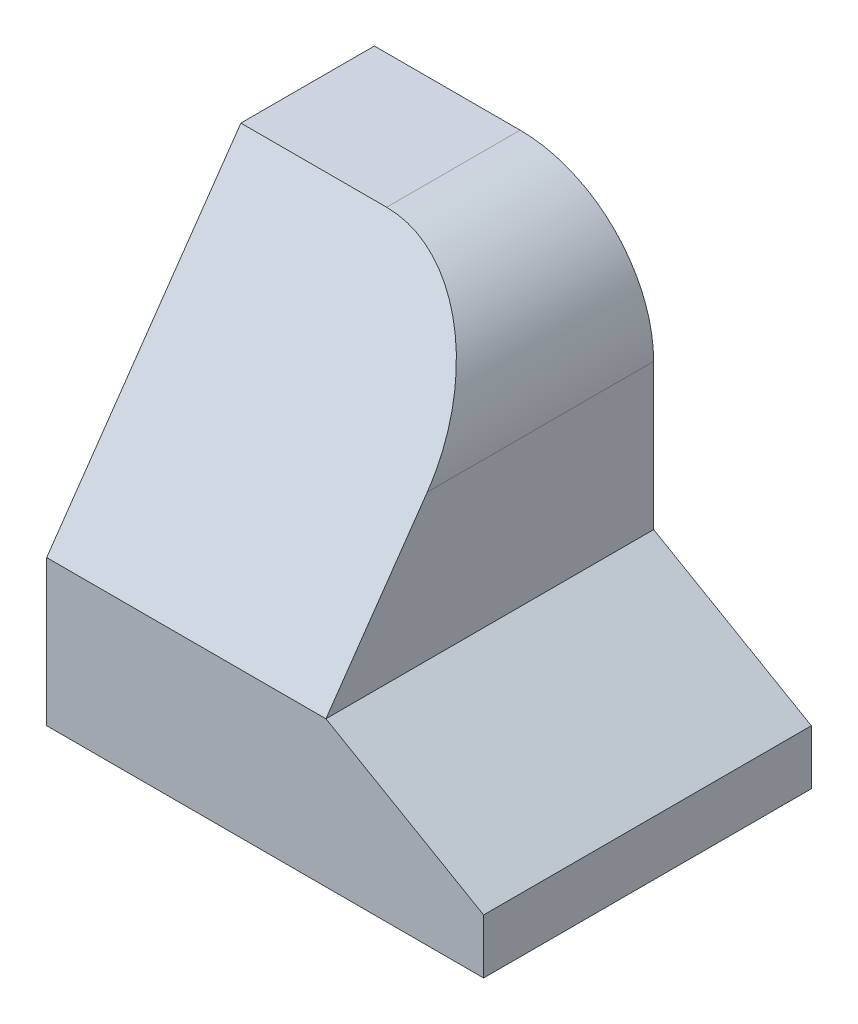
ISO-10303-21;
HEADER;
FILE_DESCRIPTION(('STEP AP214'),'2;1');
FILE_NAME('part.step','',(''),(''),'','','');
FILE_SCHEMA(('AUTOMOTIVE_DESIGN { 1 0 10303 214 1 1 1 1 }'));
ENDSEC;
DATA;
#1=APPLICATION_CONTEXT('core data for automotive mechanical design processes');
#2=APPLICATION_PROTOCOL_DEFINITION('international standard','automotive_design',2000,#1);
#3=PRODUCT_CONTEXT('',#1,'mechanical');
#4=PRODUCT('Part','Part','',(#3));
#5=PRODUCT_RELATED_PRODUCT_CATEGORY('part','',(#4));
#6=PRODUCT_DEFINITION_FORMATION('','',#4);
#7=PRODUCT_DEFINITION_CONTEXT('part definition',#1,'design');
#8=PRODUCT_DEFINITION('design','',#6,#7);
#9=PRODUCT_DEFINITION_SHAPE('','',#8);
#10=(LENGTH_UNIT() NAMED_UNIT(*) SI_UNIT(.MILLI.,.METRE.));
#11=(NAMED_UNIT(*) PLANE_ANGLE_UNIT() SI_UNIT($,.RADIAN.));
#12=(NAMED_UNIT(*) SI_UNIT($,.STERADIAN.) SOLID_ANGLE_UNIT());
#13=UNCERTAINTY_MEASURE_WITH_UNIT(LENGTH_MEASURE(1.E-05),#10,'distance_accuracy_value','');
#14=(GEOMETRIC_REPRESENTATION_CONTEXT(3) GLOBAL_UNCERTAINTY_ASSIGNED_CONTEXT((#13)) GLOBAL_UNIT_ASSIGNED_CONTEXT((#10,
#11,#12)) REPRESENTATION_CONTEXT('',''));
#15=CARTESIAN_POINT('',(0.,0.,0.));
#16=DIRECTION('',(0.,0.,1.));
#17=DIRECTION('',(1.,0.,0.));
#18=AXIS2_PLACEMENT_3D('',#15,#16,#17);
#19=CARTESIAN_POINT('',(72.,0.,54.));
#20=DIRECTION('',(0.,1.,0.));
#21=DIRECTION('',(-1.,0.,0.));
#22=AXIS2_PLACEMENT_3D('',#19,#20,#21);
#23=PLANE('',#22);
#24=DIRECTION('',(1.,0.,0.));
#25=VECTOR('',#24,1.);
#26=CARTESIAN_POINT('',(72.,0.,0.));
#27=LINE('',#26,#25);
#28=CARTESIAN_POINT('',(0.,0.,0.));
#29=VERTEX_POINT('',#28);
#30=CARTESIAN_POINT('',(72.,0.,0.));
#31=VERTEX_POINT('',#30);
#32=EDGE_CURVE('E146',#29,#31,#27,.T.);
#33=ORIENTED_EDGE('',*,*,#32,.T.);
#34=DIRECTION('',(0.,0.,-1.));
#35=VECTOR('',#34,1.);
#36=CARTESIAN_POINT('',(72.,0.,54.));
#37=LINE('',#36,#35);
#38=CARTESIAN_POINT('',(72.,0.,54.));
#39=VERTEX_POINT('',#38);
#40=EDGE_CURVE('E11',#39,#31,#37,.T.);
#41=ORIENTED_EDGE('',*,*,#40,.F.);
#42=DIRECTION('',(1.,0.,0.));
#43=VECTOR('',#42,1.);
#44=CARTESIAN_POINT('',(72.,0.,54.));
#45=LINE('',#44,#43);
#46=CARTESIAN_POINT('',(0.,0.,54.));
#47=VERTEX_POINT('',#46);
#48=EDGE_CURVE('E152',#47,#39,#45,.T.);
#49=ORIENTED_EDGE('',*,*,#48,.F.);
#50=DIRECTION('',(0.,0.,-1.));
#51=VECTOR('',#50,1.);
#52=CARTESIAN_POINT('',(0.,0.,54.));
#53=LINE('',#52,#51);
#54=EDGE_CURVE('E116',#47,#29,#53,.T.);
#55=ORIENTED_EDGE('',*,*,#54,.T.);
#56=EDGE_LOOP('',(#33,#41,#49,#55));
#57=FACE_BOUND('',#56,.T.);
#58=ADVANCED_FACE('F31',(#57),#23,.F.);
#59=CARTESIAN_POINT('',(72.,9.,54.));
#60=DIRECTION('',(-1.,0.,0.));
#61=DIRECTION('',(0.,0.,1.));
#62=AXIS2_PLACEMENT_3D('',#59,#60,#61);
#63=PLANE('',#62);
#64=DIRECTION('',(0.,1.,0.));
#65=VECTOR('',#64,1.);
#66=CARTESIAN_POINT('',(72.,9.,0.));
#67=LINE('',#66,#65);
#68=CARTESIAN_POINT('',(72.,9.,0.));
#69=VERTEX_POINT('',#68);
#70=EDGE_CURVE('E139',#31,#69,#67,.T.);
#71=ORIENTED_EDGE('',*,*,#70,.T.);
#72=DIRECTION('',(0.,0.,-1.));
#73=VECTOR('',#72,1.);
#74=CARTESIAN_POINT('',(72.,9.,54.));
#75=LINE('',#74,#73);
#76=CARTESIAN_POINT('',(72.,9.,54.));
#77=VERTEX_POINT('',#76);
#78=EDGE_CURVE('E38',#77,#69,#75,.T.);
#79=ORIENTED_EDGE('',*,*,#78,.F.);
#80=DIRECTION('',(0.,1.,0.));
#81=VECTOR('',#80,1.);
#82=CARTESIAN_POINT('',(72.,9.,54.));
#83=LINE('',#82,#81);
#84=EDGE_CURVE('E87',#39,#77,#83,.T.);
#85=ORIENTED_EDGE('',*,*,#84,.F.);
#86=ORIENTED_EDGE('',*,*,#40,.T.);
#87=EDGE_LOOP('',(#71,#79,#85,#86));
#88=FACE_BOUND('',#87,.T.);
#89=ADVANCED_FACE('F181',(#88),#63,.F.);
#90=CARTESIAN_POINT('',(46.0192378864666,24.,54.));
#91=DIRECTION('',(-0.499999999999997,-0.86602540378444,0.));
#92=DIRECTION('',(0.86602540378444,-0.499999999999997,0.));
#93=AXIS2_PLACEMENT_3D('',#90,#91,#92);
#94=PLANE('',#93);
#95=DIRECTION('',(-0.86602540378444,0.499999999999997,0.));
#96=VECTOR('',#95,1.);
#97=CARTESIAN_POINT('',(46.0192378864666,24.,0.));
#98=LINE('',#97,#96);
#99=CARTESIAN_POINT('',(46.0192378864666,24.,0.));
#100=VERTEX_POINT('',#99);
#101=EDGE_CURVE('E132',#69,#100,#98,.T.);
#102=ORIENTED_EDGE('',*,*,#101,.T.);
#103=DIRECTION('',(0.,0.,-1.));
#104=VECTOR('',#103,1.);
#105=CARTESIAN_POINT('',(46.0192378864666,24.,54.));
#106=LINE('',#105,#104);
#107=CARTESIAN_POINT('',(46.0192378864666,24.,54.));
#108=VERTEX_POINT('',#107);
#109=EDGE_CURVE('E124',#108,#100,#106,.T.);
#110=ORIENTED_EDGE('',*,*,#109,.F.);
#111=DIRECTION('',(-0.86602540378444,0.499999999999997,0.));
#112=VECTOR('',#111,1.);
#113=CARTESIAN_POINT('',(46.0192378864666,24.,54.));
#114=LINE('',#113,#112);
#115=EDGE_CURVE('E134',#77,#108,#114,.T.);
#116=ORIENTED_EDGE('',*,*,#115,.F.);
#117=ORIENTED_EDGE('',*,*,#78,.T.);
#118=EDGE_LOOP('',(#102,#110,#116,#117));
#119=FACE_BOUND('',#118,.T.);
#120=ADVANCED_FACE('F130',(#119),#94,.F.);
#121=CARTESIAN_POINT('',(46.0192378864667,47.9999999999999,54.));
#122=DIRECTION('',(-1.,0.,0.));
#123=DIRECTION('',(0.,-1.,0.));
#124=AXIS2_PLACEMENT_3D('',#121,#122,#123);
#125=PLANE('',#124);
#126=DIRECTION('',(0.,0.,-1.));
#127=VECTOR('',#126,1.);
#128=CARTESIAN_POINT('',(46.0192378864667,47.9999999999998,54.));
#129=LINE('',#128,#127);
#130=CARTESIAN_POINT('',(46.0192378864667,48.,37.304347826087));
#131=VERTEX_POINT('',#130);
#132=CARTESIAN_POINT('',(46.0192378864667,47.9999999999998,0.));
#133=VERTEX_POINT('',#132);
#134=EDGE_CURVE('E118',#131,#133,#129,.T.);
#135=ORIENTED_EDGE('',*,*,#134,.F.);
#136=DIRECTION('',(0.,0.820905201785487,-0.5710644881986));
#137=VECTOR('',#136,1.);
#138=CARTESIAN_POINT('',(46.0192378864666,24.,54.));
#139=LINE('',#138,#137);
#140=EDGE_CURVE('E110',#108,#131,#139,.T.);
#141=ORIENTED_EDGE('',*,*,#140,.F.);
#142=ORIENTED_EDGE('',*,*,#109,.T.);
#143=DIRECTION('',(0.,1.,0.));
#144=VECTOR('',#143,1.);
#145=CARTESIAN_POINT('',(46.0192378864667,47.9999999999999,0.));
#146=LINE('',#145,#144);
#147=EDGE_CURVE('E142',#100,#133,#146,.T.);
#148=ORIENTED_EDGE('',*,*,#147,.T.);
#149=EDGE_LOOP('',(#135,#141,#142,#148));
#150=FACE_BOUND('',#149,.T.);
#151=ADVANCED_FACE('F168',(#150),#125,.F.);
#152=CARTESIAN_POINT('',(24.0192378864667,48.,54.));
#153=DIRECTION('',(0.,0.,-1.));
#154=DIRECTION('',(-1.,0.,0.));
#155=AXIS2_PLACEMENT_3D('',#152,#153,#154);
#156=CYLINDRICAL_SURFACE('',#155,22.);
#157=DIRECTION('',(0.,0.,-1.));
#158=VECTOR('',#157,1.);
#159=CARTESIAN_POINT('',(24.0192378864665,70.,54.));
#160=LINE('',#159,#158);
#161=CARTESIAN_POINT('',(24.0192378864665,70.,22.));
#162=VERTEX_POINT('',#161);
#163=CARTESIAN_POINT('',(24.0192378864665,70.,0.));
#164=VERTEX_POINT('',#163);
#165=EDGE_CURVE('E115',#162,#164,#160,.T.);
#166=ORIENTED_EDGE('',*,*,#165,.F.);
#167=CARTESIAN_POINT('',(24.0192378864667,48.,37.304347826087));
#168=DIRECTION('',(0.,-0.5710644881986,-0.820905201785487));
#169=DIRECTION('',(0.,0.820905201785487,-0.5710644881986));
#170=AXIS2_PLACEMENT_3D('',#167,#168,#169);
#171=ELLIPSE('',#170,26.7996839977984,22.);
#172=EDGE_CURVE('E101',#162,#131,#171,.T.);
#173=ORIENTED_EDGE('',*,*,#172,.T.);
#174=ORIENTED_EDGE('',*,*,#134,.T.);
#175=CARTESIAN_POINT('',(24.0192378864667,48.,0.));
#176=DIRECTION('',(0.,0.,1.));
#177=DIRECTION('',(1.,0.,0.));
#178=AXIS2_PLACEMENT_3D('',#175,#176,#177);
#179=CIRCLE('',#178,22.);
#180=EDGE_CURVE('E144',#133,#164,#179,.T.);
#181=ORIENTED_EDGE('',*,*,#180,.T.);
#182=EDGE_LOOP('',(#166,#173,#174,#181));
#183=FACE_BOUND('',#182,.T.);
#184=ADVANCED_FACE('F165',(#183),#156,.T.);
#185=CARTESIAN_POINT('',(0.,70.,54.));
#186=DIRECTION('',(0.,-1.,0.));
#187=DIRECTION('',(0.,0.,-1.));
#188=AXIS2_PLACEMENT_3D('',#185,#186,#187);
#189=PLANE('',#188);
#190=DIRECTION('',(0.,0.,-1.));
#191=VECTOR('',#190,1.);
#192=CARTESIAN_POINT('',(0.,70.,54.));
#193=LINE('',#192,#191);
#194=CARTESIAN_POINT('',(0.,70.0000000000001,22.));
#195=VERTEX_POINT('',#194);
#196=CARTESIAN_POINT('',(0.,70.,0.));
#197=VERTEX_POINT('',#196);
#198=EDGE_CURVE('E108',#195,#197,#193,.T.);
#199=ORIENTED_EDGE('',*,*,#198,.F.);
#200=DIRECTION('',(1.,0.,0.));
#201=VECTOR('',#200,1.);
#202=CARTESIAN_POINT('',(0.,70.0000000000001,22.));
#203=LINE('',#202,#201);
#204=EDGE_CURVE('E98',#195,#162,#203,.T.);
#205=ORIENTED_EDGE('',*,*,#204,.T.);
#206=ORIENTED_EDGE('',*,*,#165,.T.);
#207=DIRECTION('',(-1.,0.,0.));
#208=VECTOR('',#207,1.);
#209=CARTESIAN_POINT('',(0.,70.,0.));
#210=LINE('',#209,#208);
#211=EDGE_CURVE('E114',#164,#197,#210,.T.);
#212=ORIENTED_EDGE('',*,*,#211,.T.);
#213=EDGE_LOOP('',(#199,#205,#206,#212));
#214=FACE_BOUND('',#213,.T.);
#215=ADVANCED_FACE('F112',(#214),#189,.F.);
#216=CARTESIAN_POINT('',(0.,0.,54.));
#217=DIRECTION('',(1.,0.,0.));
#218=DIRECTION('',(0.,0.,-1.));
#219=AXIS2_PLACEMENT_3D('',#216,#217,#218);
#220=PLANE('',#219);
#221=DIRECTION('',(0.,-1.,0.));
#222=VECTOR('',#221,1.);
#223=CARTESIAN_POINT('',(0.,0.,54.));
#224=LINE('',#223,#222);
#225=CARTESIAN_POINT('',(0.,24.0000000000001,54.));
#226=VERTEX_POINT('',#225);
#227=EDGE_CURVE('E53',#226,#47,#224,.T.);
#228=ORIENTED_EDGE('',*,*,#227,.F.);
#229=DIRECTION('',(0.,0.820905201785487,-0.5710644881986));
#230=VECTOR('',#229,1.);
#231=CARTESIAN_POINT('',(0.,24.0000000000001,54.));
#232=LINE('',#231,#230);
#233=EDGE_CURVE('E45',#226,#195,#232,.T.);
#234=ORIENTED_EDGE('',*,*,#233,.T.);
#235=ORIENTED_EDGE('',*,*,#198,.T.);
#236=DIRECTION('',(0.,-1.,0.));
#237=VECTOR('',#236,1.);
#238=CARTESIAN_POINT('',(0.,0.,0.));
#239=LINE('',#238,#237);
#240=EDGE_CURVE('E82',#197,#29,#239,.T.);
#241=ORIENTED_EDGE('',*,*,#240,.T.);
#242=ORIENTED_EDGE('',*,*,#54,.F.);
#243=EDGE_LOOP('',(#228,#234,#235,#241,#242));
#244=FACE_BOUND('',#243,.T.);
#245=ADVANCED_FACE('F107',(#244),#220,.F.);
#246=CARTESIAN_POINT('',(24.0192378864667,48.,54.));
#247=DIRECTION('',(0.,0.,1.));
#248=DIRECTION('',(1.,0.,0.));
#249=AXIS2_PLACEMENT_3D('',#246,#247,#248);
#250=PLANE('',#249);
#251=DIRECTION('',(1.,0.,0.));
#252=VECTOR('',#251,1.);
#253=CARTESIAN_POINT('',(0.,24.0000000000001,54.));
#254=LINE('',#253,#252);
#255=EDGE_CURVE('E105',#226,#108,#254,.T.);
#256=ORIENTED_EDGE('',*,*,#255,.F.);
#257=ORIENTED_EDGE('',*,*,#227,.T.);
#258=ORIENTED_EDGE('',*,*,#48,.T.);
#259=ORIENTED_EDGE('',*,*,#84,.T.);
#260=ORIENTED_EDGE('',*,*,#115,.T.);
#261=EDGE_LOOP('',(#256,#257,#258,#259,#260));
#262=FACE_BOUND('',#261,.T.);
#263=ADVANCED_FACE('F170',(#262),#250,.T.);
#264=CARTESIAN_POINT('',(24.0192378864667,48.,0.));
#265=DIRECTION('',(0.,0.,1.));
#266=DIRECTION('',(1.,0.,0.));
#267=AXIS2_PLACEMENT_3D('',#264,#265,#266);
#268=PLANE('',#267);
#269=ORIENTED_EDGE('',*,*,#32,.F.);
#270=ORIENTED_EDGE('',*,*,#240,.F.);
#271=ORIENTED_EDGE('',*,*,#211,.F.);
#272=ORIENTED_EDGE('',*,*,#180,.F.);
#273=ORIENTED_EDGE('',*,*,#147,.F.);
#274=ORIENTED_EDGE('',*,*,#101,.F.);
#275=ORIENTED_EDGE('',*,*,#70,.F.);
#276=EDGE_LOOP('',(#269,#270,#271,#272,#273,#274,#275));
#277=FACE_BOUND('',#276,.T.);
#278=ADVANCED_FACE('F138',(#277),#268,.F.);
#279=CARTESIAN_POINT('',(0.,24.0000000000001,54.));
#280=DIRECTION('',(0.,-0.5710644881986,-0.820905201785487));
#281=DIRECTION('',(0.,0.820905201785487,-0.5710644881986));
#282=AXIS2_PLACEMENT_3D('',#279,#280,#281);
#283=PLANE('',#282);
#284=ORIENTED_EDGE('',*,*,#204,.F.);
#285=ORIENTED_EDGE('',*,*,#233,.F.);
#286=ORIENTED_EDGE('',*,*,#255,.T.);
#287=ORIENTED_EDGE('',*,*,#140,.T.);
#288=ORIENTED_EDGE('',*,*,#172,.F.);
#289=EDGE_LOOP('',(#284,#285,#286,#287,#288));
#290=FACE_BOUND('',#289,.T.);
#291=ADVANCED_FACE('F99',(#290),#283,.F.);
#292=CLOSED_SHELL('',(#58,#89,#120,#151,#184,#215,#245,#263,#278,#291));
#293=MANIFOLD_SOLID_BREP('B2',#292);
#294=ADVANCED_BREP_SHAPE_REPRESENTATION('',(#18,#293),#14);
#295=SHAPE_DEFINITION_REPRESENTATION(#9,#294);
ENDSEC;
END-ISO-10303-21;
